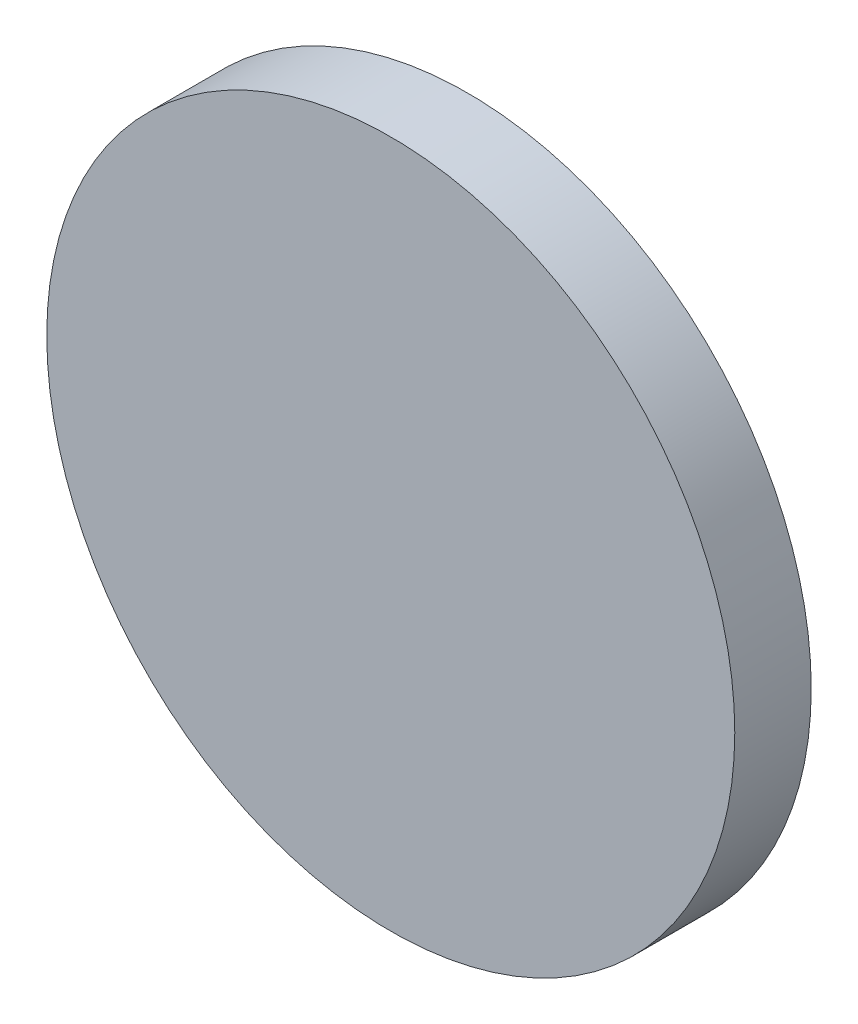
ISO-10303-21;
HEADER;
FILE_DESCRIPTION(('STEP AP214'),'2;1');
FILE_NAME('part.step','',(''),(''),'','','');
FILE_SCHEMA(('AUTOMOTIVE_DESIGN { 1 0 10303 214 1 1 1 1 }'));
ENDSEC;
DATA;
#1=APPLICATION_CONTEXT('core data for automotive mechanical design processes');
#2=APPLICATION_PROTOCOL_DEFINITION('international standard','automotive_design',2000,#1);
#3=PRODUCT_CONTEXT('',#1,'mechanical');
#4=PRODUCT('Part','Part','',(#3));
#5=PRODUCT_RELATED_PRODUCT_CATEGORY('part','',(#4));
#6=PRODUCT_DEFINITION_FORMATION('','',#4);
#7=PRODUCT_DEFINITION_CONTEXT('part definition',#1,'design');
#8=PRODUCT_DEFINITION('design','',#6,#7);
#9=PRODUCT_DEFINITION_SHAPE('','',#8);
#10=(LENGTH_UNIT() NAMED_UNIT(*) SI_UNIT(.MILLI.,.METRE.));
#11=(NAMED_UNIT(*) PLANE_ANGLE_UNIT() SI_UNIT($,.RADIAN.));
#12=(NAMED_UNIT(*) SI_UNIT($,.STERADIAN.) SOLID_ANGLE_UNIT());
#13=UNCERTAINTY_MEASURE_WITH_UNIT(LENGTH_MEASURE(1.E-05),#10,'distance_accuracy_value','');
#14=(GEOMETRIC_REPRESENTATION_CONTEXT(3) GLOBAL_UNCERTAINTY_ASSIGNED_CONTEXT((#13)) GLOBAL_UNIT_ASSIGNED_CONTEXT((#10,
#11,#12)) REPRESENTATION_CONTEXT('',''));
#15=CARTESIAN_POINT('',(0.,0.,0.));
#16=DIRECTION('',(0.,0.,1.));
#17=DIRECTION('',(1.,0.,0.));
#18=AXIS2_PLACEMENT_3D('',#15,#16,#17);
#19=CARTESIAN_POINT('',(0.,0.,25.4));
#20=DIRECTION('',(0.,0.,-1.));
#21=DIRECTION('',(-1.,0.,0.));
#22=AXIS2_PLACEMENT_3D('',#19,#20,#21);
#23=CYLINDRICAL_SURFACE('',#22,114.3);
#24=CARTESIAN_POINT('',(0.,0.,25.4));
#25=DIRECTION('',(0.,0.,1.));
#26=DIRECTION('',(1.,0.,0.));
#27=AXIS2_PLACEMENT_3D('',#24,#25,#26);
#28=CIRCLE('',#27,114.3);
#29=CARTESIAN_POINT('',(114.3,0.,25.4));
#30=VERTEX_POINT('',#29);
#31=EDGE_CURVE('E10',#30,#30,#28,.T.);
#32=ORIENTED_EDGE('',*,*,#31,.F.);
#33=EDGE_LOOP('',(#32));
#34=FACE_BOUND('',#33,.T.);
#35=CARTESIAN_POINT('',(0.,0.,0.));
#36=DIRECTION('',(0.,0.,1.));
#37=DIRECTION('',(1.,0.,0.));
#38=AXIS2_PLACEMENT_3D('',#35,#36,#37);
#39=CIRCLE('',#38,114.3);
#40=CARTESIAN_POINT('',(114.3,0.,0.));
#41=VERTEX_POINT('',#40);
#42=EDGE_CURVE('E34',#41,#41,#39,.T.);
#43=ORIENTED_EDGE('',*,*,#42,.T.);
#44=EDGE_LOOP('',(#43));
#45=FACE_BOUND('',#44,.T.);
#46=ADVANCED_FACE('F31',(#34,#45),#23,.T.);
#47=CARTESIAN_POINT('',(0.,0.,25.4));
#48=DIRECTION('',(0.,0.,1.));
#49=DIRECTION('',(1.,0.,0.));
#50=AXIS2_PLACEMENT_3D('',#47,#48,#49);
#51=PLANE('',#50);
#52=ORIENTED_EDGE('',*,*,#31,.T.);
#53=EDGE_LOOP('',(#52));
#54=FACE_BOUND('',#53,.T.);
#55=ADVANCED_FACE('F46',(#54),#51,.T.);
#56=CARTESIAN_POINT('',(0.,0.,0.));
#57=DIRECTION('',(0.,0.,1.));
#58=DIRECTION('',(1.,0.,0.));
#59=AXIS2_PLACEMENT_3D('',#56,#57,#58);
#60=PLANE('',#59);
#61=ORIENTED_EDGE('',*,*,#42,.F.);
#62=EDGE_LOOP('',(#61));
#63=FACE_BOUND('',#62,.T.);
#64=ADVANCED_FACE('F44',(#63),#60,.F.);
#65=CLOSED_SHELL('',(#46,#55,#64));
#66=MANIFOLD_SOLID_BREP('B2',#65);
#67=ADVANCED_BREP_SHAPE_REPRESENTATION('',(#18,#66),#14);
#68=SHAPE_DEFINITION_REPRESENTATION(#9,#67);
ENDSEC;
END-ISO-10303-21;
